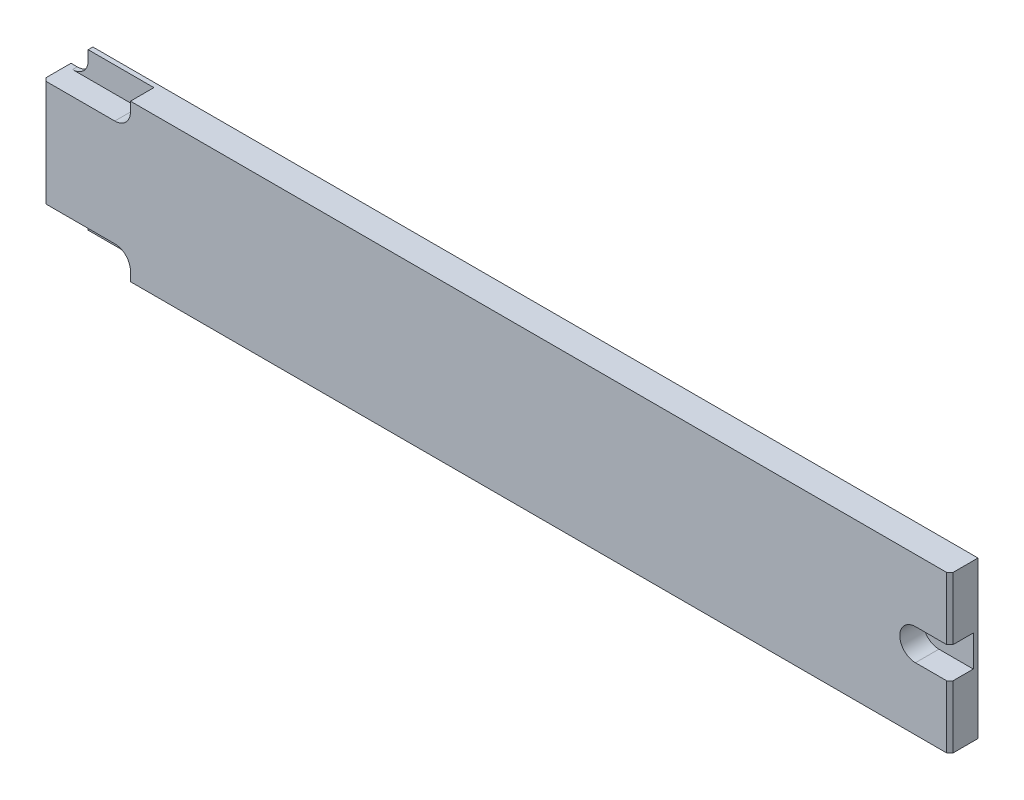
ISO-10303-21;
HEADER;
FILE_DESCRIPTION(('STEP AP214'),'2;1');
FILE_NAME('part.step','',(''),(''),'','','');
FILE_SCHEMA(('AUTOMOTIVE_DESIGN { 1 0 10303 214 1 1 1 1 }'));
ENDSEC;
DATA;
#1=APPLICATION_CONTEXT('core data for automotive mechanical design processes');
#2=APPLICATION_PROTOCOL_DEFINITION('international standard','automotive_design',2000,#1);
#3=PRODUCT_CONTEXT('',#1,'mechanical');
#4=PRODUCT('Part','Part','',(#3));
#5=PRODUCT_RELATED_PRODUCT_CATEGORY('part','',(#4));
#6=PRODUCT_DEFINITION_FORMATION('','',#4);
#7=PRODUCT_DEFINITION_CONTEXT('part definition',#1,'design');
#8=PRODUCT_DEFINITION('design','',#6,#7);
#9=PRODUCT_DEFINITION_SHAPE('','',#8);
#10=(LENGTH_UNIT() NAMED_UNIT(*) SI_UNIT(.MILLI.,.METRE.));
#11=(NAMED_UNIT(*) PLANE_ANGLE_UNIT() SI_UNIT($,.RADIAN.));
#12=(NAMED_UNIT(*) SI_UNIT($,.STERADIAN.) SOLID_ANGLE_UNIT());
#13=UNCERTAINTY_MEASURE_WITH_UNIT(LENGTH_MEASURE(1.E-05),#10,'distance_accuracy_value','');
#14=(GEOMETRIC_REPRESENTATION_CONTEXT(3) GLOBAL_UNCERTAINTY_ASSIGNED_CONTEXT((#13)) GLOBAL_UNIT_ASSIGNED_CONTEXT((#10,
#11,#12)) REPRESENTATION_CONTEXT('',''));
#15=CARTESIAN_POINT('',(0.,0.,0.));
#16=DIRECTION('',(0.,0.,1.));
#17=DIRECTION('',(1.,0.,0.));
#18=AXIS2_PLACEMENT_3D('',#15,#16,#17);
#19=CARTESIAN_POINT('',(7.,0.,9.));
#20=DIRECTION('',(0.,1.,0.));
#21=DIRECTION('',(0.,0.,1.));
#22=AXIS2_PLACEMENT_3D('',#19,#20,#21);
#23=PLANE('',#22);
#24=DIRECTION('',(0.,0.,-1.));
#25=VECTOR('',#24,1.);
#26=CARTESIAN_POINT('',(290.,0.,9.));
#27=LINE('',#26,#25);
#28=CARTESIAN_POINT('',(290.,0.,7.99999999999998));
#29=VERTEX_POINT('',#28);
#30=CARTESIAN_POINT('',(290.,0.,0.));
#31=VERTEX_POINT('',#30);
#32=EDGE_CURVE('E300',#29,#31,#27,.T.);
#33=ORIENTED_EDGE('',*,*,#32,.F.);
#34=DIRECTION('',(-0.707106781186541,0.,0.707106781186554));
#35=VECTOR('',#34,1.);
#36=CARTESIAN_POINT('',(290.,0.,7.99999999999998));
#37=LINE('',#36,#35);
#38=CARTESIAN_POINT('',(289.,0.,9.));
#39=VERTEX_POINT('',#38);
#40=EDGE_CURVE('E355',#29,#39,#37,.T.);
#41=ORIENTED_EDGE('',*,*,#40,.T.);
#42=DIRECTION('',(1.,0.,0.));
#43=VECTOR('',#42,1.);
#44=CARTESIAN_POINT('',(7.,0.,9.));
#45=LINE('',#44,#43);
#46=CARTESIAN_POINT('',(28.,0.,9.));
#47=VERTEX_POINT('',#46);
#48=EDGE_CURVE('E290',#47,#39,#45,.T.);
#49=ORIENTED_EDGE('',*,*,#48,.F.);
#50=DIRECTION('',(0.,0.,1.));
#51=VECTOR('',#50,1.);
#52=CARTESIAN_POINT('',(28.,0.,-27.2029410174709));
#53=LINE('',#52,#51);
#54=CARTESIAN_POINT('',(28.,0.,1.5));
#55=VERTEX_POINT('',#54);
#56=EDGE_CURVE('E266',#55,#47,#53,.T.);
#57=ORIENTED_EDGE('',*,*,#56,.F.);
#58=DIRECTION('',(-1.,0.,0.));
#59=VECTOR('',#58,1.);
#60=CARTESIAN_POINT('',(28.,0.,1.5));
#61=LINE('',#60,#59);
#62=CARTESIAN_POINT('',(7.,0.,1.5));
#63=VERTEX_POINT('',#62);
#64=EDGE_CURVE('E270',#55,#63,#61,.T.);
#65=ORIENTED_EDGE('',*,*,#64,.T.);
#66=DIRECTION('',(0.,0.,-1.));
#67=VECTOR('',#66,1.);
#68=CARTESIAN_POINT('',(7.,0.,9.));
#69=LINE('',#68,#67);
#70=CARTESIAN_POINT('',(7.,0.,0.));
#71=VERTEX_POINT('',#70);
#72=EDGE_CURVE('E344',#63,#71,#69,.T.);
#73=ORIENTED_EDGE('',*,*,#72,.T.);
#74=DIRECTION('',(1.,0.,0.));
#75=VECTOR('',#74,1.);
#76=CARTESIAN_POINT('',(7.,0.,0.));
#77=LINE('',#76,#75);
#78=EDGE_CURVE('E303',#71,#31,#77,.T.);
#79=ORIENTED_EDGE('',*,*,#78,.T.);
#80=EDGE_LOOP('',(#33,#41,#49,#57,#65,#73,#79));
#81=FACE_BOUND('',#80,.T.);
#82=ADVANCED_FACE('F40',(#81),#23,.F.);
#83=CARTESIAN_POINT('',(2.,3.,9.));
#84=DIRECTION('',(0.,0.,-1.));
#85=DIRECTION('',(-1.,0.,0.));
#86=AXIS2_PLACEMENT_3D('',#83,#84,#85);
#87=PLANE('',#86);
#88=ORIENTED_EDGE('',*,*,#48,.T.);
#89=DIRECTION('',(0.,1.,0.));
#90=VECTOR('',#89,1.);
#91=CARTESIAN_POINT('',(289.,20.,9.));
#92=LINE('',#91,#90);
#93=CARTESIAN_POINT('',(289.,20.,9.));
#94=VERTEX_POINT('',#93);
#95=EDGE_CURVE('E361',#39,#94,#92,.T.);
#96=ORIENTED_EDGE('',*,*,#95,.T.);
#97=DIRECTION('',(1.,0.,0.));
#98=VECTOR('',#97,1.);
#99=CARTESIAN_POINT('',(279.,20.,9.));
#100=LINE('',#99,#98);
#101=CARTESIAN_POINT('',(279.,20.,9.));
#102=VERTEX_POINT('',#101);
#103=EDGE_CURVE('E230',#102,#94,#100,.T.);
#104=ORIENTED_EDGE('',*,*,#103,.F.);
#105=CARTESIAN_POINT('',(279.,25.,9.));
#106=DIRECTION('',(0.,0.,-1.));
#107=DIRECTION('',(-1.,0.,0.));
#108=AXIS2_PLACEMENT_3D('',#105,#106,#107);
#109=CIRCLE('',#108,5.);
#110=CARTESIAN_POINT('',(279.,30.,9.));
#111=VERTEX_POINT('',#110);
#112=EDGE_CURVE('E240',#102,#111,#109,.T.);
#113=ORIENTED_EDGE('',*,*,#112,.T.);
#114=DIRECTION('',(1.,0.,0.));
#115=VECTOR('',#114,1.);
#116=CARTESIAN_POINT('',(279.,30.,9.));
#117=LINE('',#116,#115);
#118=CARTESIAN_POINT('',(289.,30.,9.));
#119=VERTEX_POINT('',#118);
#120=EDGE_CURVE('E235',#111,#119,#117,.T.);
#121=ORIENTED_EDGE('',*,*,#120,.T.);
#122=DIRECTION('',(0.,1.,0.));
#123=VECTOR('',#122,1.);
#124=CARTESIAN_POINT('',(289.,50.,9.));
#125=LINE('',#124,#123);
#126=CARTESIAN_POINT('',(289.,50.,9.));
#127=VERTEX_POINT('',#126);
#128=EDGE_CURVE('E359',#119,#127,#125,.T.);
#129=ORIENTED_EDGE('',*,*,#128,.T.);
#130=DIRECTION('',(-1.,0.,0.));
#131=VECTOR('',#130,1.);
#132=CARTESIAN_POINT('',(290.,50.,9.));
#133=LINE('',#132,#131);
#134=CARTESIAN_POINT('',(28.,49.9999999999999,9.));
#135=VERTEX_POINT('',#134);
#136=EDGE_CURVE('E298',#127,#135,#133,.T.);
#137=ORIENTED_EDGE('',*,*,#136,.T.);
#138=DIRECTION('',(0.,1.,0.));
#139=VECTOR('',#138,1.);
#140=CARTESIAN_POINT('',(28.,47.,9.));
#141=LINE('',#140,#139);
#142=CARTESIAN_POINT('',(28.,47.,9.));
#143=VERTEX_POINT('',#142);
#144=EDGE_CURVE('E200',#143,#135,#141,.T.);
#145=ORIENTED_EDGE('',*,*,#144,.F.);
#146=CARTESIAN_POINT('',(23.,47.,9.));
#147=DIRECTION('',(0.,0.,1.));
#148=DIRECTION('',(1.,0.,0.));
#149=AXIS2_PLACEMENT_3D('',#146,#147,#148);
#150=CIRCLE('',#149,5.00000000000001);
#151=CARTESIAN_POINT('',(23.,42.,9.));
#152=VERTEX_POINT('',#151);
#153=EDGE_CURVE('E380',#152,#143,#150,.T.);
#154=ORIENTED_EDGE('',*,*,#153,.F.);
#155=DIRECTION('',(1.,0.,0.));
#156=VECTOR('',#155,1.);
#157=CARTESIAN_POINT('',(0.,42.,9.));
#158=LINE('',#157,#156);
#159=CARTESIAN_POINT('',(1.00000000000001,42.,9.));
#160=VERTEX_POINT('',#159);
#161=EDGE_CURVE('E296',#160,#152,#158,.T.);
#162=ORIENTED_EDGE('',*,*,#161,.F.);
#163=DIRECTION('',(0.,-1.,0.));
#164=VECTOR('',#163,1.);
#165=CARTESIAN_POINT('',(1.00000000000001,8.,9.));
#166=LINE('',#165,#164);
#167=CARTESIAN_POINT('',(1.00000000000001,8.,9.));
#168=VERTEX_POINT('',#167);
#169=EDGE_CURVE('E357',#160,#168,#166,.T.);
#170=ORIENTED_EDGE('',*,*,#169,.T.);
#171=DIRECTION('',(1.,0.,0.));
#172=VECTOR('',#171,1.);
#173=CARTESIAN_POINT('',(0.,8.,9.));
#174=LINE('',#173,#172);
#175=CARTESIAN_POINT('',(23.,8.,9.));
#176=VERTEX_POINT('',#175);
#177=EDGE_CURVE('E293',#168,#176,#174,.T.);
#178=ORIENTED_EDGE('',*,*,#177,.T.);
#179=CARTESIAN_POINT('',(23.,3.,9.));
#180=DIRECTION('',(0.,0.,-1.));
#181=DIRECTION('',(-1.,0.,0.));
#182=AXIS2_PLACEMENT_3D('',#179,#180,#181);
#183=CIRCLE('',#182,5.);
#184=CARTESIAN_POINT('',(28.,3.,9.));
#185=VERTEX_POINT('',#184);
#186=EDGE_CURVE('E259',#176,#185,#183,.T.);
#187=ORIENTED_EDGE('',*,*,#186,.T.);
#188=DIRECTION('',(0.,-1.,0.));
#189=VECTOR('',#188,1.);
#190=CARTESIAN_POINT('',(28.,3.,9.));
#191=LINE('',#190,#189);
#192=EDGE_CURVE('E263',#185,#47,#191,.T.);
#193=ORIENTED_EDGE('',*,*,#192,.T.);
#194=EDGE_LOOP('',(#88,#96,#104,#113,#121,#129,#137,#145,#154,#162,#170,#178,#187,#193));
#195=FACE_BOUND('',#194,.T.);
#196=ADVANCED_FACE('F378',(#195),#87,.F.);
#197=CARTESIAN_POINT('',(290.,50.,9.));
#198=DIRECTION('',(1.,0.,0.));
#199=DIRECTION('',(0.,0.,-1.));
#200=AXIS2_PLACEMENT_3D('',#197,#198,#199);
#201=PLANE('',#200);
#202=DIRECTION('',(0.,0.,1.));
#203=VECTOR('',#202,1.);
#204=CARTESIAN_POINT('',(290.,20.,-27.2029410174709));
#205=LINE('',#204,#203);
#206=CARTESIAN_POINT('',(290.,20.,1.5));
#207=VERTEX_POINT('',#206);
#208=CARTESIAN_POINT('',(290.,20.,7.99999999999992));
#209=VERTEX_POINT('',#208);
#210=EDGE_CURVE('E246',#207,#209,#205,.T.);
#211=ORIENTED_EDGE('',*,*,#210,.T.);
#212=DIRECTION('',(0.,-1.,0.));
#213=VECTOR('',#212,1.);
#214=CARTESIAN_POINT('',(290.,0.,7.99999999999998));
#215=LINE('',#214,#213);
#216=EDGE_CURVE('E352',#209,#29,#215,.T.);
#217=ORIENTED_EDGE('',*,*,#216,.T.);
#218=ORIENTED_EDGE('',*,*,#32,.T.);
#219=DIRECTION('',(0.,-1.,0.));
#220=VECTOR('',#219,1.);
#221=CARTESIAN_POINT('',(290.,50.,0.));
#222=LINE('',#221,#220);
#223=CARTESIAN_POINT('',(290.,50.,0.));
#224=VERTEX_POINT('',#223);
#225=EDGE_CURVE('E289',#224,#31,#222,.T.);
#226=ORIENTED_EDGE('',*,*,#225,.F.);
#227=DIRECTION('',(0.,0.,-1.));
#228=VECTOR('',#227,1.);
#229=CARTESIAN_POINT('',(290.,50.,9.));
#230=LINE('',#229,#228);
#231=CARTESIAN_POINT('',(290.,50.,7.99999999999998));
#232=VERTEX_POINT('',#231);
#233=EDGE_CURVE('E328',#232,#224,#230,.T.);
#234=ORIENTED_EDGE('',*,*,#233,.F.);
#235=DIRECTION('',(0.,-1.,0.));
#236=VECTOR('',#235,1.);
#237=CARTESIAN_POINT('',(290.,30.,7.99999999999998));
#238=LINE('',#237,#236);
#239=CARTESIAN_POINT('',(290.,30.,7.99999999999993));
#240=VERTEX_POINT('',#239);
#241=EDGE_CURVE('E349',#232,#240,#238,.T.);
#242=ORIENTED_EDGE('',*,*,#241,.T.);
#243=DIRECTION('',(0.,0.,1.));
#244=VECTOR('',#243,1.);
#245=CARTESIAN_POINT('',(290.,30.,-27.2029410174709));
#246=LINE('',#245,#244);
#247=CARTESIAN_POINT('',(290.,30.,1.5));
#248=VERTEX_POINT('',#247);
#249=EDGE_CURVE('E252',#248,#240,#246,.T.);
#250=ORIENTED_EDGE('',*,*,#249,.F.);
#251=DIRECTION('',(0.,1.,0.));
#252=VECTOR('',#251,1.);
#253=CARTESIAN_POINT('',(290.,20.,1.5));
#254=LINE('',#253,#252);
#255=EDGE_CURVE('E250',#207,#248,#254,.T.);
#256=ORIENTED_EDGE('',*,*,#255,.F.);
#257=EDGE_LOOP('',(#211,#217,#218,#226,#234,#242,#250,#256));
#258=FACE_BOUND('',#257,.T.);
#259=ADVANCED_FACE('F414',(#258),#201,.T.);
#260=CARTESIAN_POINT('',(290.,50.,9.));
#261=DIRECTION('',(0.,-1.,0.));
#262=DIRECTION('',(0.,0.,-1.));
#263=AXIS2_PLACEMENT_3D('',#260,#261,#262);
#264=PLANE('',#263);
#265=ORIENTED_EDGE('',*,*,#136,.F.);
#266=DIRECTION('',(0.707106781186541,0.,-0.707106781186554));
#267=VECTOR('',#266,1.);
#268=CARTESIAN_POINT('',(290.,50.,7.99999999999998));
#269=LINE('',#268,#267);
#270=EDGE_CURVE('E367',#127,#232,#269,.T.);
#271=ORIENTED_EDGE('',*,*,#270,.T.);
#272=ORIENTED_EDGE('',*,*,#233,.T.);
#273=DIRECTION('',(-1.,0.,0.));
#274=VECTOR('',#273,1.);
#275=CARTESIAN_POINT('',(290.,50.,0.));
#276=LINE('',#275,#274);
#277=CARTESIAN_POINT('',(7.,50.,0.));
#278=VERTEX_POINT('',#277);
#279=EDGE_CURVE('E294',#224,#278,#276,.T.);
#280=ORIENTED_EDGE('',*,*,#279,.T.);
#281=DIRECTION('',(0.,0.,-1.));
#282=VECTOR('',#281,1.);
#283=CARTESIAN_POINT('',(7.,50.,9.));
#284=LINE('',#283,#282);
#285=CARTESIAN_POINT('',(7.,49.9999999999999,1.5));
#286=VERTEX_POINT('',#285);
#287=EDGE_CURVE('E216',#286,#278,#284,.T.);
#288=ORIENTED_EDGE('',*,*,#287,.F.);
#289=DIRECTION('',(-1.,0.,0.));
#290=VECTOR('',#289,1.);
#291=CARTESIAN_POINT('',(28.,49.9999999999999,1.5));
#292=LINE('',#291,#290);
#293=CARTESIAN_POINT('',(28.,49.9999999999999,1.5));
#294=VERTEX_POINT('',#293);
#295=EDGE_CURVE('E204',#294,#286,#292,.T.);
#296=ORIENTED_EDGE('',*,*,#295,.F.);
#297=DIRECTION('',(0.,0.,1.));
#298=VECTOR('',#297,1.);
#299=CARTESIAN_POINT('',(28.,49.9999999999999,-27.2029410174709));
#300=LINE('',#299,#298);
#301=EDGE_CURVE('E194',#294,#135,#300,.T.);
#302=ORIENTED_EDGE('',*,*,#301,.T.);
#303=EDGE_LOOP('',(#265,#271,#272,#280,#288,#296,#302));
#304=FACE_BOUND('',#303,.T.);
#305=ADVANCED_FACE('F214',(#304),#264,.F.);
#306=CARTESIAN_POINT('',(7.,47.,9.));
#307=DIRECTION('',(-1.,0.,0.));
#308=DIRECTION('',(0.,0.,1.));
#309=AXIS2_PLACEMENT_3D('',#306,#307,#308);
#310=PLANE('',#309);
#311=DIRECTION('',(0.,-1.,0.));
#312=VECTOR('',#311,1.);
#313=CARTESIAN_POINT('',(7.,47.,1.5));
#314=LINE('',#313,#312);
#315=CARTESIAN_POINT('',(7.,47.,1.5));
#316=VERTEX_POINT('',#315);
#317=EDGE_CURVE('E227',#286,#316,#314,.T.);
#318=ORIENTED_EDGE('',*,*,#317,.F.);
#319=ORIENTED_EDGE('',*,*,#287,.T.);
#320=DIRECTION('',(0.,1.,0.));
#321=VECTOR('',#320,1.);
#322=CARTESIAN_POINT('',(7.,47.,0.));
#323=LINE('',#322,#321);
#324=CARTESIAN_POINT('',(7.,47.,0.));
#325=VERTEX_POINT('',#324);
#326=EDGE_CURVE('E324',#325,#278,#323,.T.);
#327=ORIENTED_EDGE('',*,*,#326,.F.);
#328=DIRECTION('',(0.,0.,-1.));
#329=VECTOR('',#328,1.);
#330=CARTESIAN_POINT('',(7.,47.,9.));
#331=LINE('',#330,#329);
#332=EDGE_CURVE('E332',#316,#325,#331,.T.);
#333=ORIENTED_EDGE('',*,*,#332,.F.);
#334=EDGE_LOOP('',(#318,#319,#327,#333));
#335=FACE_BOUND('',#334,.T.);
#336=ADVANCED_FACE('F443',(#335),#310,.T.);
#337=CARTESIAN_POINT('',(2.,47.,9.));
#338=DIRECTION('',(0.,0.,-1.));
#339=DIRECTION('',(-1.,0.,0.));
#340=AXIS2_PLACEMENT_3D('',#337,#338,#339);
#341=CYLINDRICAL_SURFACE('',#340,5.);
#342=CARTESIAN_POINT('',(2.,47.,1.5));
#343=DIRECTION('',(0.,0.,-1.));
#344=DIRECTION('',(-1.,0.,0.));
#345=AXIS2_PLACEMENT_3D('',#342,#343,#344);
#346=CIRCLE('',#345,5.);
#347=CARTESIAN_POINT('',(2.,42.,1.5));
#348=VERTEX_POINT('',#347);
#349=EDGE_CURVE('E330',#316,#348,#346,.T.);
#350=ORIENTED_EDGE('',*,*,#349,.F.);
#351=ORIENTED_EDGE('',*,*,#332,.T.);
#352=CARTESIAN_POINT('',(2.,47.,0.));
#353=DIRECTION('',(0.,0.,1.));
#354=DIRECTION('',(1.,0.,0.));
#355=AXIS2_PLACEMENT_3D('',#352,#353,#354);
#356=CIRCLE('',#355,5.);
#357=CARTESIAN_POINT('',(2.,42.,0.));
#358=VERTEX_POINT('',#357);
#359=EDGE_CURVE('E321',#358,#325,#356,.T.);
#360=ORIENTED_EDGE('',*,*,#359,.F.);
#361=DIRECTION('',(0.,0.,-1.));
#362=VECTOR('',#361,1.);
#363=CARTESIAN_POINT('',(2.,42.,9.));
#364=LINE('',#363,#362);
#365=EDGE_CURVE('E334',#348,#358,#364,.T.);
#366=ORIENTED_EDGE('',*,*,#365,.F.);
#367=EDGE_LOOP('',(#350,#351,#360,#366));
#368=FACE_BOUND('',#367,.T.);
#369=ADVANCED_FACE('F447',(#368),#341,.F.);
#370=CARTESIAN_POINT('',(0.,42.,9.));
#371=DIRECTION('',(0.,1.,0.));
#372=DIRECTION('',(0.,0.,1.));
#373=AXIS2_PLACEMENT_3D('',#370,#371,#372);
#374=PLANE('',#373);
#375=DIRECTION('',(0.,0.,-1.));
#376=VECTOR('',#375,1.);
#377=CARTESIAN_POINT('',(0.,42.,9.));
#378=LINE('',#377,#376);
#379=CARTESIAN_POINT('',(0.,42.,7.99999999999998));
#380=VERTEX_POINT('',#379);
#381=CARTESIAN_POINT('',(0.,42.,0.));
#382=VERTEX_POINT('',#381);
#383=EDGE_CURVE('E336',#380,#382,#378,.T.);
#384=ORIENTED_EDGE('',*,*,#383,.F.);
#385=DIRECTION('',(0.707106781186544,0.,0.707106781186551));
#386=VECTOR('',#385,1.);
#387=CARTESIAN_POINT('',(0.500000000000009,42.,8.49999999999999));
#388=LINE('',#387,#386);
#389=EDGE_CURVE('E48',#380,#160,#388,.T.);
#390=ORIENTED_EDGE('',*,*,#389,.T.);
#391=ORIENTED_EDGE('',*,*,#161,.T.);
#392=DIRECTION('',(0.,0.,1.));
#393=VECTOR('',#392,1.);
#394=CARTESIAN_POINT('',(23.,42.,-27.2029410174709));
#395=LINE('',#394,#393);
#396=CARTESIAN_POINT('',(23.,42.,1.5));
#397=VERTEX_POINT('',#396);
#398=EDGE_CURVE('E219',#397,#152,#395,.T.);
#399=ORIENTED_EDGE('',*,*,#398,.F.);
#400=DIRECTION('',(1.,0.,0.));
#401=VECTOR('',#400,1.);
#402=CARTESIAN_POINT('',(2.,42.,1.5));
#403=LINE('',#402,#401);
#404=EDGE_CURVE('E217',#348,#397,#403,.T.);
#405=ORIENTED_EDGE('',*,*,#404,.F.);
#406=ORIENTED_EDGE('',*,*,#365,.T.);
#407=DIRECTION('',(1.,0.,0.));
#408=VECTOR('',#407,1.);
#409=CARTESIAN_POINT('',(0.,42.,0.));
#410=LINE('',#409,#408);
#411=EDGE_CURVE('E318',#382,#358,#410,.T.);
#412=ORIENTED_EDGE('',*,*,#411,.F.);
#413=EDGE_LOOP('',(#384,#390,#391,#399,#405,#406,#412));
#414=FACE_BOUND('',#413,.T.);
#415=ADVANCED_FACE('F373',(#414),#374,.T.);
#416=CARTESIAN_POINT('',(0.,8.,9.));
#417=DIRECTION('',(-1.,0.,0.));
#418=DIRECTION('',(0.,0.,1.));
#419=AXIS2_PLACEMENT_3D('',#416,#417,#418);
#420=PLANE('',#419);
#421=DIRECTION('',(0.,0.,-1.));
#422=VECTOR('',#421,1.);
#423=CARTESIAN_POINT('',(0.,8.,9.));
#424=LINE('',#423,#422);
#425=CARTESIAN_POINT('',(0.,8.,7.99999999999998));
#426=VERTEX_POINT('',#425);
#427=CARTESIAN_POINT('',(0.,8.,0.));
#428=VERTEX_POINT('',#427);
#429=EDGE_CURVE('E338',#426,#428,#424,.T.);
#430=ORIENTED_EDGE('',*,*,#429,.F.);
#431=DIRECTION('',(0.,1.,0.));
#432=VECTOR('',#431,1.);
#433=CARTESIAN_POINT('',(0.,42.,7.99999999999998));
#434=LINE('',#433,#432);
#435=EDGE_CURVE('E369',#426,#380,#434,.T.);
#436=ORIENTED_EDGE('',*,*,#435,.T.);
#437=ORIENTED_EDGE('',*,*,#383,.T.);
#438=DIRECTION('',(0.,1.,0.));
#439=VECTOR('',#438,1.);
#440=CARTESIAN_POINT('',(0.,8.,0.));
#441=LINE('',#440,#439);
#442=EDGE_CURVE('E315',#428,#382,#441,.T.);
#443=ORIENTED_EDGE('',*,*,#442,.F.);
#444=EDGE_LOOP('',(#430,#436,#437,#443));
#445=FACE_BOUND('',#444,.T.);
#446=ADVANCED_FACE('F382',(#445),#420,.T.);
#447=CARTESIAN_POINT('',(0.,8.,9.));
#448=DIRECTION('',(0.,1.,0.));
#449=DIRECTION('',(0.,0.,1.));
#450=AXIS2_PLACEMENT_3D('',#447,#448,#449);
#451=PLANE('',#450);
#452=ORIENTED_EDGE('',*,*,#177,.F.);
#453=DIRECTION('',(-0.707106781186544,0.,-0.707106781186551));
#454=VECTOR('',#453,1.);
#455=CARTESIAN_POINT('',(0.,8.,7.99999999999998));
#456=LINE('',#455,#454);
#457=EDGE_CURVE('E12',#168,#426,#456,.T.);
#458=ORIENTED_EDGE('',*,*,#457,.T.);
#459=ORIENTED_EDGE('',*,*,#429,.T.);
#460=DIRECTION('',(1.,0.,0.));
#461=VECTOR('',#460,1.);
#462=CARTESIAN_POINT('',(0.,8.,0.));
#463=LINE('',#462,#461);
#464=CARTESIAN_POINT('',(2.,8.,0.));
#465=VERTEX_POINT('',#464);
#466=EDGE_CURVE('E312',#428,#465,#463,.T.);
#467=ORIENTED_EDGE('',*,*,#466,.T.);
#468=DIRECTION('',(0.,0.,-1.));
#469=VECTOR('',#468,1.);
#470=CARTESIAN_POINT('',(2.,8.,9.));
#471=LINE('',#470,#469);
#472=CARTESIAN_POINT('',(2.,8.,1.5));
#473=VERTEX_POINT('',#472);
#474=EDGE_CURVE('E340',#473,#465,#471,.T.);
#475=ORIENTED_EDGE('',*,*,#474,.F.);
#476=DIRECTION('',(1.,0.,0.));
#477=VECTOR('',#476,1.);
#478=CARTESIAN_POINT('',(2.,8.,1.5));
#479=LINE('',#478,#477);
#480=CARTESIAN_POINT('',(23.,8.,1.5));
#481=VERTEX_POINT('',#480);
#482=EDGE_CURVE('E274',#473,#481,#479,.T.);
#483=ORIENTED_EDGE('',*,*,#482,.T.);
#484=DIRECTION('',(0.,0.,1.));
#485=VECTOR('',#484,1.);
#486=CARTESIAN_POINT('',(23.,8.,-27.2029410174709));
#487=LINE('',#486,#485);
#488=EDGE_CURVE('E243',#481,#176,#487,.T.);
#489=ORIENTED_EDGE('',*,*,#488,.T.);
#490=EDGE_LOOP('',(#452,#458,#459,#467,#475,#483,#489));
#491=FACE_BOUND('',#490,.T.);
#492=ADVANCED_FACE('F385',(#491),#451,.F.);
#493=CARTESIAN_POINT('',(2.,3.,9.));
#494=DIRECTION('',(0.,0.,-1.));
#495=DIRECTION('',(-1.,0.,0.));
#496=AXIS2_PLACEMENT_3D('',#493,#494,#495);
#497=CYLINDRICAL_SURFACE('',#496,5.);
#498=DIRECTION('',(0.,0.,-1.));
#499=VECTOR('',#498,1.);
#500=CARTESIAN_POINT('',(7.,3.,9.));
#501=LINE('',#500,#499);
#502=CARTESIAN_POINT('',(7.,3.,1.5));
#503=VERTEX_POINT('',#502);
#504=CARTESIAN_POINT('',(7.,3.,0.));
#505=VERTEX_POINT('',#504);
#506=EDGE_CURVE('E342',#503,#505,#501,.T.);
#507=ORIENTED_EDGE('',*,*,#506,.F.);
#508=CARTESIAN_POINT('',(2.,3.,1.5));
#509=DIRECTION('',(0.,0.,-1.));
#510=DIRECTION('',(-1.,0.,0.));
#511=AXIS2_PLACEMENT_3D('',#508,#509,#510);
#512=CIRCLE('',#511,5.);
#513=EDGE_CURVE('E286',#503,#473,#512,.F.);
#514=ORIENTED_EDGE('',*,*,#513,.T.);
#515=ORIENTED_EDGE('',*,*,#474,.T.);
#516=CARTESIAN_POINT('',(2.,3.,0.));
#517=DIRECTION('',(0.,0.,-1.));
#518=DIRECTION('',(-1.,0.,0.));
#519=AXIS2_PLACEMENT_3D('',#516,#517,#518);
#520=CIRCLE('',#519,5.);
#521=EDGE_CURVE('E309',#465,#505,#520,.T.);
#522=ORIENTED_EDGE('',*,*,#521,.T.);
#523=EDGE_LOOP('',(#507,#514,#515,#522));
#524=FACE_BOUND('',#523,.T.);
#525=ADVANCED_FACE('F394',(#524),#497,.F.);
#526=CARTESIAN_POINT('',(7.,3.,9.));
#527=DIRECTION('',(1.,0.,0.));
#528=DIRECTION('',(0.,0.,-1.));
#529=AXIS2_PLACEMENT_3D('',#526,#527,#528);
#530=PLANE('',#529);
#531=ORIENTED_EDGE('',*,*,#72,.F.);
#532=DIRECTION('',(0.,1.,0.));
#533=VECTOR('',#532,1.);
#534=CARTESIAN_POINT('',(7.,3.,1.5));
#535=LINE('',#534,#533);
#536=EDGE_CURVE('E279',#63,#503,#535,.T.);
#537=ORIENTED_EDGE('',*,*,#536,.T.);
#538=ORIENTED_EDGE('',*,*,#506,.T.);
#539=DIRECTION('',(0.,-1.,0.));
#540=VECTOR('',#539,1.);
#541=CARTESIAN_POINT('',(7.,3.,0.));
#542=LINE('',#541,#540);
#543=EDGE_CURVE('E306',#505,#71,#542,.T.);
#544=ORIENTED_EDGE('',*,*,#543,.T.);
#545=EDGE_LOOP('',(#531,#537,#538,#544));
#546=FACE_BOUND('',#545,.T.);
#547=ADVANCED_FACE('F468',(#546),#530,.F.);
#548=CARTESIAN_POINT('',(2.,3.,0.));
#549=DIRECTION('',(0.,0.,-1.));
#550=DIRECTION('',(-1.,0.,0.));
#551=AXIS2_PLACEMENT_3D('',#548,#549,#550);
#552=PLANE('',#551);
#553=ORIENTED_EDGE('',*,*,#225,.T.);
#554=ORIENTED_EDGE('',*,*,#78,.F.);
#555=ORIENTED_EDGE('',*,*,#543,.F.);
#556=ORIENTED_EDGE('',*,*,#521,.F.);
#557=ORIENTED_EDGE('',*,*,#466,.F.);
#558=ORIENTED_EDGE('',*,*,#442,.T.);
#559=ORIENTED_EDGE('',*,*,#411,.T.);
#560=ORIENTED_EDGE('',*,*,#359,.T.);
#561=ORIENTED_EDGE('',*,*,#326,.T.);
#562=ORIENTED_EDGE('',*,*,#279,.F.);
#563=EDGE_LOOP('',(#553,#554,#555,#556,#557,#558,#559,#560,#561,#562));
#564=FACE_BOUND('',#563,.T.);
#565=ADVANCED_FACE('F389',(#564),#552,.T.);
#566=CARTESIAN_POINT('',(2.,3.,1.5));
#567=DIRECTION('',(0.,0.,-1.));
#568=DIRECTION('',(-1.,0.,0.));
#569=AXIS2_PLACEMENT_3D('',#566,#567,#568);
#570=PLANE('',#569);
#571=ORIENTED_EDGE('',*,*,#536,.F.);
#572=ORIENTED_EDGE('',*,*,#64,.F.);
#573=DIRECTION('',(0.,-1.,0.));
#574=VECTOR('',#573,1.);
#575=CARTESIAN_POINT('',(28.,3.,1.5));
#576=LINE('',#575,#574);
#577=CARTESIAN_POINT('',(28.,3.,1.5));
#578=VERTEX_POINT('',#577);
#579=EDGE_CURVE('E267',#578,#55,#576,.T.);
#580=ORIENTED_EDGE('',*,*,#579,.F.);
#581=CARTESIAN_POINT('',(23.,3.,1.5));
#582=DIRECTION('',(0.,0.,-1.));
#583=DIRECTION('',(-1.,0.,0.));
#584=AXIS2_PLACEMENT_3D('',#581,#582,#583);
#585=CIRCLE('',#584,5.);
#586=EDGE_CURVE('E271',#481,#578,#585,.T.);
#587=ORIENTED_EDGE('',*,*,#586,.F.);
#588=ORIENTED_EDGE('',*,*,#482,.F.);
#589=ORIENTED_EDGE('',*,*,#513,.F.);
#590=EDGE_LOOP('',(#571,#572,#580,#587,#588,#589));
#591=FACE_BOUND('',#590,.T.);
#592=ADVANCED_FACE('F398',(#591),#570,.F.);
#593=CARTESIAN_POINT('',(23.,3.,-27.2029410174709));
#594=DIRECTION('',(0.,0.,1.));
#595=DIRECTION('',(1.,0.,0.));
#596=AXIS2_PLACEMENT_3D('',#593,#594,#595);
#597=CYLINDRICAL_SURFACE('',#596,5.);
#598=ORIENTED_EDGE('',*,*,#586,.T.);
#599=DIRECTION('',(0.,0.,1.));
#600=VECTOR('',#599,1.);
#601=CARTESIAN_POINT('',(28.,3.,-27.2029410174709));
#602=LINE('',#601,#600);
#603=EDGE_CURVE('E262',#578,#185,#602,.T.);
#604=ORIENTED_EDGE('',*,*,#603,.T.);
#605=ORIENTED_EDGE('',*,*,#186,.F.);
#606=ORIENTED_EDGE('',*,*,#488,.F.);
#607=EDGE_LOOP('',(#598,#604,#605,#606));
#608=FACE_BOUND('',#607,.T.);
#609=ADVANCED_FACE('F401',(#608),#597,.F.);
#610=CARTESIAN_POINT('',(28.,3.,-27.2029410174709));
#611=DIRECTION('',(-1.,0.,0.));
#612=DIRECTION('',(0.,-1.,0.));
#613=AXIS2_PLACEMENT_3D('',#610,#611,#612);
#614=PLANE('',#613);
#615=ORIENTED_EDGE('',*,*,#579,.T.);
#616=ORIENTED_EDGE('',*,*,#56,.T.);
#617=ORIENTED_EDGE('',*,*,#192,.F.);
#618=ORIENTED_EDGE('',*,*,#603,.F.);
#619=EDGE_LOOP('',(#615,#616,#617,#618));
#620=FACE_BOUND('',#619,.T.);
#621=ADVANCED_FACE('F522',(#620),#614,.T.);
#622=CARTESIAN_POINT('',(2.,3.,1.5));
#623=DIRECTION('',(0.,0.,-1.));
#624=DIRECTION('',(-1.,0.,0.));
#625=AXIS2_PLACEMENT_3D('',#622,#623,#624);
#626=PLANE('',#625);
#627=DIRECTION('',(1.,0.,0.));
#628=VECTOR('',#627,1.);
#629=CARTESIAN_POINT('',(279.,20.,1.5));
#630=LINE('',#629,#628);
#631=CARTESIAN_POINT('',(279.,20.,1.5));
#632=VERTEX_POINT('',#631);
#633=EDGE_CURVE('E233',#632,#207,#630,.T.);
#634=ORIENTED_EDGE('',*,*,#633,.T.);
#635=ORIENTED_EDGE('',*,*,#255,.T.);
#636=DIRECTION('',(1.,0.,0.));
#637=VECTOR('',#636,1.);
#638=CARTESIAN_POINT('',(279.,30.,1.5));
#639=LINE('',#638,#637);
#640=CARTESIAN_POINT('',(279.,30.,1.5));
#641=VERTEX_POINT('',#640);
#642=EDGE_CURVE('E234',#641,#248,#639,.T.);
#643=ORIENTED_EDGE('',*,*,#642,.F.);
#644=CARTESIAN_POINT('',(279.,25.,1.5));
#645=DIRECTION('',(0.,0.,-1.));
#646=DIRECTION('',(-1.,0.,0.));
#647=AXIS2_PLACEMENT_3D('',#644,#645,#646);
#648=CIRCLE('',#647,5.);
#649=EDGE_CURVE('E229',#632,#641,#648,.T.);
#650=ORIENTED_EDGE('',*,*,#649,.F.);
#651=EDGE_LOOP('',(#634,#635,#643,#650));
#652=FACE_BOUND('',#651,.T.);
#653=ADVANCED_FACE('F422',(#652),#626,.F.);
#654=CARTESIAN_POINT('',(279.,20.,-27.2029410174709));
#655=DIRECTION('',(0.,-1.,0.));
#656=DIRECTION('',(0.,0.,-1.));
#657=AXIS2_PLACEMENT_3D('',#654,#655,#656);
#658=PLANE('',#657);
#659=ORIENTED_EDGE('',*,*,#103,.T.);
#660=DIRECTION('',(0.707106781186541,0.,-0.707106781186554));
#661=VECTOR('',#660,1.);
#662=CARTESIAN_POINT('',(290.,20.,7.99999999999998));
#663=LINE('',#662,#661);
#664=EDGE_CURVE('E363',#94,#209,#663,.T.);
#665=ORIENTED_EDGE('',*,*,#664,.T.);
#666=ORIENTED_EDGE('',*,*,#210,.F.);
#667=ORIENTED_EDGE('',*,*,#633,.F.);
#668=DIRECTION('',(0.,0.,1.));
#669=VECTOR('',#668,1.);
#670=CARTESIAN_POINT('',(279.,20.,-27.2029410174709));
#671=LINE('',#670,#669);
#672=EDGE_CURVE('E238',#632,#102,#671,.T.);
#673=ORIENTED_EDGE('',*,*,#672,.T.);
#674=EDGE_LOOP('',(#659,#665,#666,#667,#673));
#675=FACE_BOUND('',#674,.T.);
#676=ADVANCED_FACE('F419',(#675),#658,.F.);
#677=CARTESIAN_POINT('',(279.,30.,-27.2029410174709));
#678=DIRECTION('',(0.,-1.,0.));
#679=DIRECTION('',(0.,0.,-1.));
#680=AXIS2_PLACEMENT_3D('',#677,#678,#679);
#681=PLANE('',#680);
#682=ORIENTED_EDGE('',*,*,#249,.T.);
#683=DIRECTION('',(-0.707106781186541,0.,0.707106781186554));
#684=VECTOR('',#683,1.);
#685=CARTESIAN_POINT('',(302.101470508736,30.,-4.10147050873578));
#686=LINE('',#685,#684);
#687=EDGE_CURVE('E365',#240,#119,#686,.T.);
#688=ORIENTED_EDGE('',*,*,#687,.T.);
#689=ORIENTED_EDGE('',*,*,#120,.F.);
#690=DIRECTION('',(0.,0.,1.));
#691=VECTOR('',#690,1.);
#692=CARTESIAN_POINT('',(279.,30.,-27.2029410174709));
#693=LINE('',#692,#691);
#694=EDGE_CURVE('E239',#641,#111,#693,.T.);
#695=ORIENTED_EDGE('',*,*,#694,.F.);
#696=ORIENTED_EDGE('',*,*,#642,.T.);
#697=EDGE_LOOP('',(#682,#688,#689,#695,#696));
#698=FACE_BOUND('',#697,.T.);
#699=ADVANCED_FACE('F503',(#698),#681,.T.);
#700=CARTESIAN_POINT('',(279.,25.,-27.2029410174709));
#701=DIRECTION('',(0.,0.,1.));
#702=DIRECTION('',(1.,0.,0.));
#703=AXIS2_PLACEMENT_3D('',#700,#701,#702);
#704=CYLINDRICAL_SURFACE('',#703,5.);
#705=ORIENTED_EDGE('',*,*,#649,.T.);
#706=ORIENTED_EDGE('',*,*,#694,.T.);
#707=ORIENTED_EDGE('',*,*,#112,.F.);
#708=ORIENTED_EDGE('',*,*,#672,.F.);
#709=EDGE_LOOP('',(#705,#706,#707,#708));
#710=FACE_BOUND('',#709,.T.);
#711=ADVANCED_FACE('F428',(#710),#704,.F.);
#712=CARTESIAN_POINT('',(2.,3.,1.5));
#713=DIRECTION('',(0.,0.,-1.));
#714=DIRECTION('',(-1.,0.,0.));
#715=AXIS2_PLACEMENT_3D('',#712,#713,#714);
#716=PLANE('',#715);
#717=ORIENTED_EDGE('',*,*,#317,.T.);
#718=ORIENTED_EDGE('',*,*,#349,.T.);
#719=ORIENTED_EDGE('',*,*,#404,.T.);
#720=CARTESIAN_POINT('',(23.,47.,1.5));
#721=DIRECTION('',(0.,0.,-1.));
#722=DIRECTION('',(-1.,0.,0.));
#723=AXIS2_PLACEMENT_3D('',#720,#721,#722);
#724=CIRCLE('',#723,5.00000000000001);
#725=CARTESIAN_POINT('',(28.,47.,1.5));
#726=VERTEX_POINT('',#725);
#727=EDGE_CURVE('E210',#397,#726,#724,.F.);
#728=ORIENTED_EDGE('',*,*,#727,.T.);
#729=DIRECTION('',(0.,1.,0.));
#730=VECTOR('',#729,1.);
#731=CARTESIAN_POINT('',(28.,47.,1.5));
#732=LINE('',#731,#730);
#733=EDGE_CURVE('E197',#726,#294,#732,.T.);
#734=ORIENTED_EDGE('',*,*,#733,.T.);
#735=ORIENTED_EDGE('',*,*,#295,.T.);
#736=EDGE_LOOP('',(#717,#718,#719,#728,#734,#735));
#737=FACE_BOUND('',#736,.T.);
#738=ADVANCED_FACE('F207',(#737),#716,.F.);
#739=CARTESIAN_POINT('',(28.,47.,-27.2029410174709));
#740=DIRECTION('',(1.,0.,0.));
#741=DIRECTION('',(0.,1.,0.));
#742=AXIS2_PLACEMENT_3D('',#739,#740,#741);
#743=PLANE('',#742);
#744=DIRECTION('',(0.,0.,1.));
#745=VECTOR('',#744,1.);
#746=CARTESIAN_POINT('',(28.,47.,-27.2029410174709));
#747=LINE('',#746,#745);
#748=EDGE_CURVE('E225',#726,#143,#747,.T.);
#749=ORIENTED_EDGE('',*,*,#748,.T.);
#750=ORIENTED_EDGE('',*,*,#144,.T.);
#751=ORIENTED_EDGE('',*,*,#301,.F.);
#752=ORIENTED_EDGE('',*,*,#733,.F.);
#753=EDGE_LOOP('',(#749,#750,#751,#752));
#754=FACE_BOUND('',#753,.T.);
#755=ADVANCED_FACE('F196',(#754),#743,.F.);
#756=CARTESIAN_POINT('',(23.,47.,-27.2029410174709));
#757=DIRECTION('',(0.,0.,1.));
#758=DIRECTION('',(1.,0.,0.));
#759=AXIS2_PLACEMENT_3D('',#756,#757,#758);
#760=CYLINDRICAL_SURFACE('',#759,5.00000000000001);
#761=ORIENTED_EDGE('',*,*,#398,.T.);
#762=ORIENTED_EDGE('',*,*,#153,.T.);
#763=ORIENTED_EDGE('',*,*,#748,.F.);
#764=ORIENTED_EDGE('',*,*,#727,.F.);
#765=EDGE_LOOP('',(#761,#762,#763,#764));
#766=FACE_BOUND('',#765,.T.);
#767=ADVANCED_FACE('F449',(#766),#760,.F.);
#768=CARTESIAN_POINT('',(290.,50.,7.99999999999998));
#769=DIRECTION('',(0.707106781186554,0.,0.707106781186541));
#770=DIRECTION('',(0.707106781186541,0.,-0.707106781186554));
#771=AXIS2_PLACEMENT_3D('',#768,#769,#770);
#772=PLANE('',#771);
#773=ORIENTED_EDGE('',*,*,#664,.F.);
#774=ORIENTED_EDGE('',*,*,#95,.F.);
#775=ORIENTED_EDGE('',*,*,#40,.F.);
#776=ORIENTED_EDGE('',*,*,#216,.F.);
#777=EDGE_LOOP('',(#773,#774,#775,#776));
#778=FACE_BOUND('',#777,.T.);
#779=ADVANCED_FACE('F412',(#778),#772,.T.);
#780=CARTESIAN_POINT('',(290.,50.,7.99999999999998));
#781=DIRECTION('',(0.707106781186554,0.,0.707106781186541));
#782=DIRECTION('',(0.707106781186541,0.,-0.707106781186554));
#783=AXIS2_PLACEMENT_3D('',#780,#781,#782);
#784=PLANE('',#783);
#785=ORIENTED_EDGE('',*,*,#270,.F.);
#786=ORIENTED_EDGE('',*,*,#128,.F.);
#787=ORIENTED_EDGE('',*,*,#687,.F.);
#788=ORIENTED_EDGE('',*,*,#241,.F.);
#789=EDGE_LOOP('',(#785,#786,#787,#788));
#790=FACE_BOUND('',#789,.T.);
#791=ADVANCED_FACE('F435',(#790),#784,.T.);
#792=CARTESIAN_POINT('',(0.,8.,7.99999999999998));
#793=DIRECTION('',(-0.707106781186551,0.,0.707106781186544));
#794=DIRECTION('',(0.707106781186544,0.,0.707106781186551));
#795=AXIS2_PLACEMENT_3D('',#792,#793,#794);
#796=PLANE('',#795);
#797=ORIENTED_EDGE('',*,*,#457,.F.);
#798=ORIENTED_EDGE('',*,*,#169,.F.);
#799=ORIENTED_EDGE('',*,*,#389,.F.);
#800=ORIENTED_EDGE('',*,*,#435,.F.);
#801=EDGE_LOOP('',(#797,#798,#799,#800));
#802=FACE_BOUND('',#801,.T.);
#803=ADVANCED_FACE('F42',(#802),#796,.T.);
#804=CLOSED_SHELL('',(#82,#196,#259,#305,#336,#369,#415,#446,#492,#525,#547,#565,#592,#609,#621,
#653,#676,#699,#711,#738,#755,#767,#779,#791,#803));
#805=MANIFOLD_SOLID_BREP('B2',#804);
#806=ADVANCED_BREP_SHAPE_REPRESENTATION('',(#18,#805),#14);
#807=SHAPE_DEFINITION_REPRESENTATION(#9,#806);
ENDSEC;
END-ISO-10303-21;
